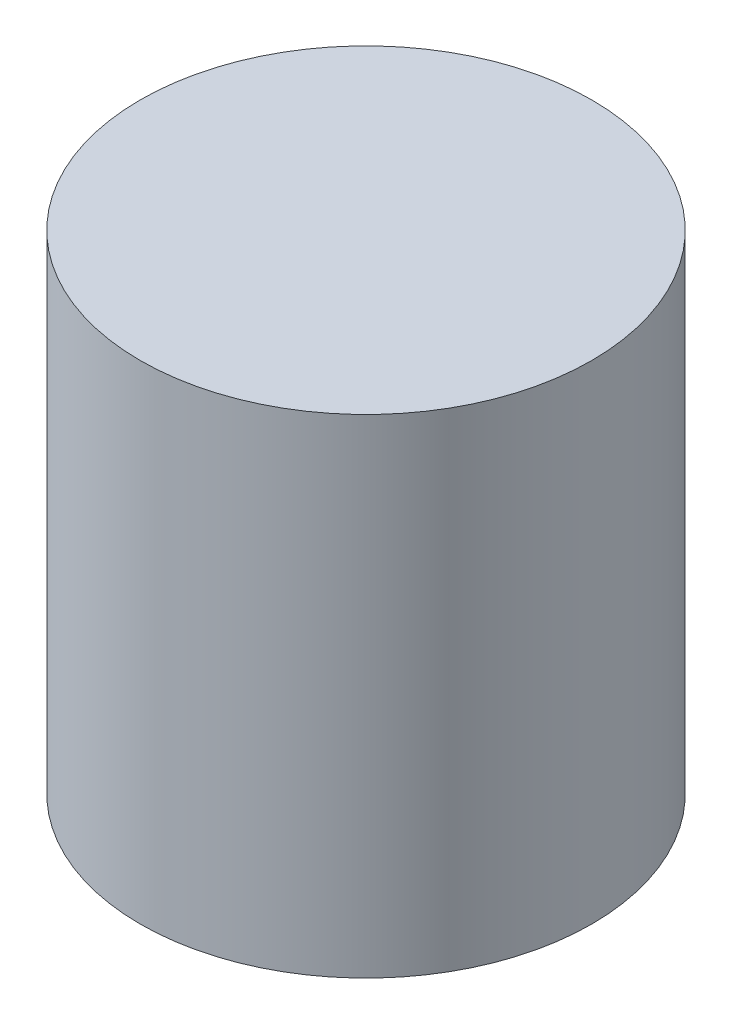
ISO-10303-21;
HEADER;
FILE_DESCRIPTION(('STEP AP214'),'2;1');
FILE_NAME('part.step','',(''),(''),'','','');
FILE_SCHEMA(('AUTOMOTIVE_DESIGN { 1 0 10303 214 1 1 1 1 }'));
ENDSEC;
DATA;
#1=APPLICATION_CONTEXT('core data for automotive mechanical design processes');
#2=APPLICATION_PROTOCOL_DEFINITION('international standard','automotive_design',2000,#1);
#3=PRODUCT_CONTEXT('',#1,'mechanical');
#4=PRODUCT('Part','Part','',(#3));
#5=PRODUCT_RELATED_PRODUCT_CATEGORY('part','',(#4));
#6=PRODUCT_DEFINITION_FORMATION('','',#4);
#7=PRODUCT_DEFINITION_CONTEXT('part definition',#1,'design');
#8=PRODUCT_DEFINITION('design','',#6,#7);
#9=PRODUCT_DEFINITION_SHAPE('','',#8);
#10=(LENGTH_UNIT() NAMED_UNIT(*) SI_UNIT(.MILLI.,.METRE.));
#11=(NAMED_UNIT(*) PLANE_ANGLE_UNIT() SI_UNIT($,.RADIAN.));
#12=(NAMED_UNIT(*) SI_UNIT($,.STERADIAN.) SOLID_ANGLE_UNIT());
#13=UNCERTAINTY_MEASURE_WITH_UNIT(LENGTH_MEASURE(1.E-05),#10,'distance_accuracy_value','');
#14=(GEOMETRIC_REPRESENTATION_CONTEXT(3) GLOBAL_UNCERTAINTY_ASSIGNED_CONTEXT((#13)) GLOBAL_UNIT_ASSIGNED_CONTEXT((#10,
#11,#12)) REPRESENTATION_CONTEXT('',''));
#15=CARTESIAN_POINT('',(0.,0.,0.));
#16=DIRECTION('',(0.,0.,1.));
#17=DIRECTION('',(1.,0.,0.));
#18=AXIS2_PLACEMENT_3D('',#15,#16,#17);
#19=CARTESIAN_POINT('',(0.,40.,0.));
#20=DIRECTION('',(0.,-1.,0.));
#21=DIRECTION('',(0.,0.,-1.));
#22=AXIS2_PLACEMENT_3D('',#19,#20,#21);
#23=CYLINDRICAL_SURFACE('',#22,18.5);
#24=CARTESIAN_POINT('',(0.,40.,0.));
#25=DIRECTION('',(0.,1.,0.));
#26=DIRECTION('',(0.,0.,1.));
#27=AXIS2_PLACEMENT_3D('',#24,#25,#26);
#28=CIRCLE('',#27,18.5);
#29=CARTESIAN_POINT('',(0.,40.,18.5));
#30=VERTEX_POINT('',#29);
#31=EDGE_CURVE('E10',#30,#30,#28,.T.);
#32=ORIENTED_EDGE('',*,*,#31,.F.);
#33=EDGE_LOOP('',(#32));
#34=FACE_BOUND('',#33,.T.);
#35=CARTESIAN_POINT('',(0.,0.,0.));
#36=DIRECTION('',(0.,1.,0.));
#37=DIRECTION('',(0.,0.,1.));
#38=AXIS2_PLACEMENT_3D('',#35,#36,#37);
#39=CIRCLE('',#38,18.5);
#40=CARTESIAN_POINT('',(0.,0.,18.5));
#41=VERTEX_POINT('',#40);
#42=EDGE_CURVE('E44',#41,#41,#39,.T.);
#43=ORIENTED_EDGE('',*,*,#42,.T.);
#44=EDGE_LOOP('',(#43));
#45=FACE_BOUND('',#44,.T.);
#46=ADVANCED_FACE('F41',(#34,#45),#23,.T.);
#47=CARTESIAN_POINT('',(0.,40.,0.));
#48=DIRECTION('',(0.,1.,0.));
#49=DIRECTION('',(0.,0.,1.));
#50=AXIS2_PLACEMENT_3D('',#47,#48,#49);
#51=PLANE('',#50);
#52=ORIENTED_EDGE('',*,*,#31,.T.);
#53=EDGE_LOOP('',(#52));
#54=FACE_BOUND('',#53,.T.);
#55=ADVANCED_FACE('F58',(#54),#51,.T.);
#56=CARTESIAN_POINT('',(0.,0.,0.));
#57=DIRECTION('',(0.,1.,0.));
#58=DIRECTION('',(0.,0.,1.));
#59=AXIS2_PLACEMENT_3D('',#56,#57,#58);
#60=PLANE('',#59);
#61=ORIENTED_EDGE('',*,*,#42,.F.);
#62=EDGE_LOOP('',(#61));
#63=FACE_BOUND('',#62,.T.);
#64=ADVANCED_FACE('F56',(#63),#60,.F.);
#65=CLOSED_SHELL('',(#46,#55,#64));
#66=MANIFOLD_SOLID_BREP('B2',#65);
#67=ADVANCED_BREP_SHAPE_REPRESENTATION('',(#18,#66),#14);
#68=SHAPE_DEFINITION_REPRESENTATION(#9,#67);
ENDSEC;
END-ISO-10303-21;
